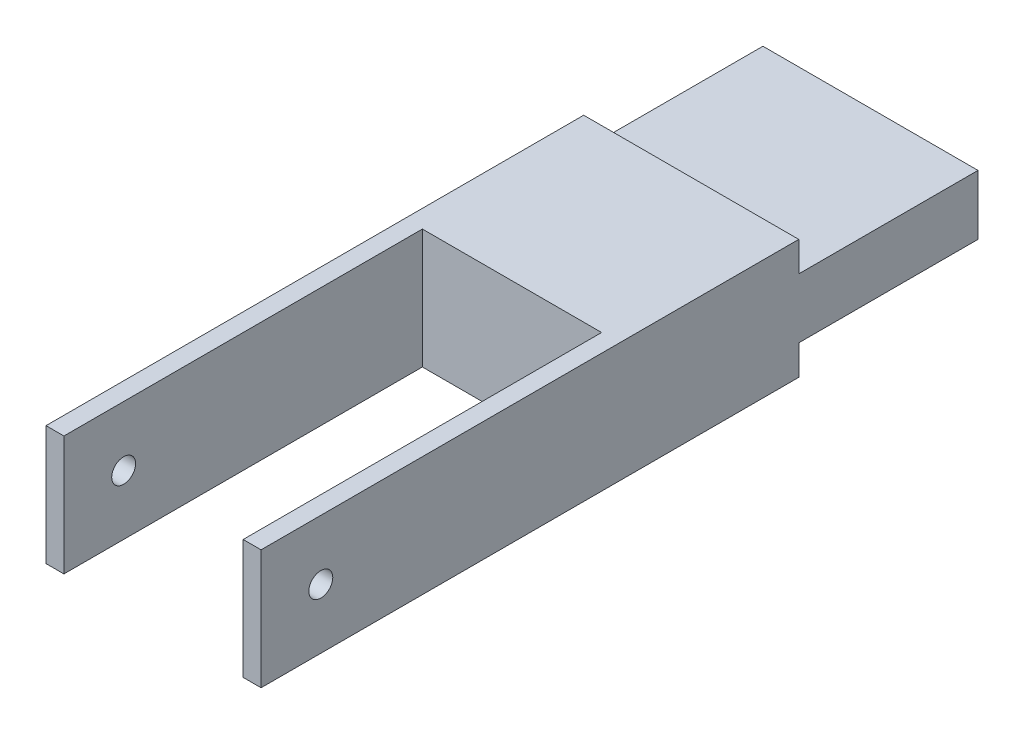
ISO-10303-21;
HEADER;
FILE_DESCRIPTION(('STEP AP214'),'2;1');
FILE_NAME('part.step','',(''),(''),'','','');
FILE_SCHEMA(('AUTOMOTIVE_DESIGN { 1 0 10303 214 1 1 1 1 }'));
ENDSEC;
DATA;
#1=APPLICATION_CONTEXT('core data for automotive mechanical design processes');
#2=APPLICATION_PROTOCOL_DEFINITION('international standard','automotive_design',2000,#1);
#3=PRODUCT_CONTEXT('',#1,'mechanical');
#4=PRODUCT('Part','Part','',(#3));
#5=PRODUCT_RELATED_PRODUCT_CATEGORY('part','',(#4));
#6=PRODUCT_DEFINITION_FORMATION('','',#4);
#7=PRODUCT_DEFINITION_CONTEXT('part definition',#1,'design');
#8=PRODUCT_DEFINITION('design','',#6,#7);
#9=PRODUCT_DEFINITION_SHAPE('','',#8);
#10=(LENGTH_UNIT() NAMED_UNIT(*) SI_UNIT(.MILLI.,.METRE.));
#11=(NAMED_UNIT(*) PLANE_ANGLE_UNIT() SI_UNIT($,.RADIAN.));
#12=(NAMED_UNIT(*) SI_UNIT($,.STERADIAN.) SOLID_ANGLE_UNIT());
#13=UNCERTAINTY_MEASURE_WITH_UNIT(LENGTH_MEASURE(1.E-05),#10,'distance_accuracy_value','');
#14=(GEOMETRIC_REPRESENTATION_CONTEXT(3) GLOBAL_UNCERTAINTY_ASSIGNED_CONTEXT((#13)) GLOBAL_UNIT_ASSIGNED_CONTEXT((#10,
#11,#12)) REPRESENTATION_CONTEXT('',''));
#15=CARTESIAN_POINT('',(0.,0.,0.));
#16=DIRECTION('',(0.,0.,1.));
#17=DIRECTION('',(1.,0.,0.));
#18=AXIS2_PLACEMENT_3D('',#15,#16,#17);
#19=CARTESIAN_POINT('',(-18.,20.,60.));
#20=DIRECTION('',(0.,0.,-1.));
#21=DIRECTION('',(-1.,0.,0.));
#22=AXIS2_PLACEMENT_3D('',#19,#20,#21);
#23=PLANE('',#22);
#24=DIRECTION('',(1.,0.,0.));
#25=VECTOR('',#24,1.);
#26=CARTESIAN_POINT('',(-18.,20.,60.));
#27=LINE('',#26,#25);
#28=CARTESIAN_POINT('',(15.,20.,60.));
#29=VERTEX_POINT('',#28);
#30=CARTESIAN_POINT('',(18.,20.,60.));
#31=VERTEX_POINT('',#30);
#32=EDGE_CURVE('E175',#29,#31,#27,.T.);
#33=ORIENTED_EDGE('',*,*,#32,.F.);
#34=DIRECTION('',(0.,-1.,0.));
#35=VECTOR('',#34,1.);
#36=CARTESIAN_POINT('',(15.,20.,60.));
#37=LINE('',#36,#35);
#38=CARTESIAN_POINT('',(15.,0.,60.));
#39=VERTEX_POINT('',#38);
#40=EDGE_CURVE('E185',#29,#39,#37,.T.);
#41=ORIENTED_EDGE('',*,*,#40,.T.);
#42=DIRECTION('',(1.,0.,0.));
#43=VECTOR('',#42,1.);
#44=CARTESIAN_POINT('',(-18.,0.,60.));
#45=LINE('',#44,#43);
#46=CARTESIAN_POINT('',(18.,0.,60.));
#47=VERTEX_POINT('',#46);
#48=EDGE_CURVE('E182',#39,#47,#45,.T.);
#49=ORIENTED_EDGE('',*,*,#48,.T.);
#50=DIRECTION('',(0.,-1.,0.));
#51=VECTOR('',#50,1.);
#52=CARTESIAN_POINT('',(18.,20.,60.));
#53=LINE('',#52,#51);
#54=EDGE_CURVE('E191',#31,#47,#53,.T.);
#55=ORIENTED_EDGE('',*,*,#54,.F.);
#56=EDGE_LOOP('',(#33,#41,#49,#55));
#57=FACE_BOUND('',#56,.T.);
#58=ADVANCED_FACE('F37',(#57),#23,.F.);
#59=CARTESIAN_POINT('',(18.,20.,-60.));
#60=DIRECTION('',(-1.,0.,0.));
#61=DIRECTION('',(0.,0.,1.));
#62=AXIS2_PLACEMENT_3D('',#59,#60,#61);
#63=PLANE('',#62);
#64=CARTESIAN_POINT('',(18.,10.,50.));
#65=DIRECTION('',(1.,0.,0.));
#66=DIRECTION('',(0.,0.,-1.));
#67=AXIS2_PLACEMENT_3D('',#64,#65,#66);
#68=CIRCLE('',#67,2.);
#69=CARTESIAN_POINT('',(18.,10.,48.));
#70=VERTEX_POINT('',#69);
#71=EDGE_CURVE('E251',#70,#70,#68,.T.);
#72=ORIENTED_EDGE('',*,*,#71,.F.);
#73=EDGE_LOOP('',(#72));
#74=FACE_BOUND('',#73,.T.);
#75=DIRECTION('',(0.,-1.,0.));
#76=VECTOR('',#75,1.);
#77=CARTESIAN_POINT('',(18.,20.,-60.));
#78=LINE('',#77,#76);
#79=CARTESIAN_POINT('',(18.,15.,-60.));
#80=VERTEX_POINT('',#79);
#81=CARTESIAN_POINT('',(18.,5.,-60.));
#82=VERTEX_POINT('',#81);
#83=EDGE_CURVE('E144',#80,#82,#78,.T.);
#84=ORIENTED_EDGE('',*,*,#83,.F.);
#85=DIRECTION('',(0.,0.,1.));
#86=VECTOR('',#85,1.);
#87=CARTESIAN_POINT('',(18.,15.,-60.));
#88=LINE('',#87,#86);
#89=CARTESIAN_POINT('',(18.,15.,-30.));
#90=VERTEX_POINT('',#89);
#91=EDGE_CURVE('E129',#80,#90,#88,.T.);
#92=ORIENTED_EDGE('',*,*,#91,.T.);
#93=DIRECTION('',(0.,1.,0.));
#94=VECTOR('',#93,1.);
#95=CARTESIAN_POINT('',(18.,20.,-30.));
#96=LINE('',#95,#94);
#97=CARTESIAN_POINT('',(18.,20.,-30.));
#98=VERTEX_POINT('',#97);
#99=EDGE_CURVE('E138',#90,#98,#96,.T.);
#100=ORIENTED_EDGE('',*,*,#99,.T.);
#101=DIRECTION('',(0.,0.,-1.));
#102=VECTOR('',#101,1.);
#103=CARTESIAN_POINT('',(18.,20.,-60.));
#104=LINE('',#103,#102);
#105=EDGE_CURVE('E170',#31,#98,#104,.T.);
#106=ORIENTED_EDGE('',*,*,#105,.F.);
#107=ORIENTED_EDGE('',*,*,#54,.T.);
#108=DIRECTION('',(0.,0.,-1.));
#109=VECTOR('',#108,1.);
#110=CARTESIAN_POINT('',(18.,0.,-60.));
#111=LINE('',#110,#109);
#112=CARTESIAN_POINT('',(18.,0.,-30.));
#113=VERTEX_POINT('',#112);
#114=EDGE_CURVE('E192',#47,#113,#111,.T.);
#115=ORIENTED_EDGE('',*,*,#114,.T.);
#116=DIRECTION('',(0.,1.,0.));
#117=VECTOR('',#116,1.);
#118=CARTESIAN_POINT('',(18.,20.,-30.));
#119=LINE('',#118,#117);
#120=CARTESIAN_POINT('',(18.,5.,-30.));
#121=VERTEX_POINT('',#120);
#122=EDGE_CURVE('E61',#113,#121,#119,.T.);
#123=ORIENTED_EDGE('',*,*,#122,.T.);
#124=DIRECTION('',(0.,0.,-1.));
#125=VECTOR('',#124,1.);
#126=CARTESIAN_POINT('',(18.,5.,-60.));
#127=LINE('',#126,#125);
#128=EDGE_CURVE('E150',#121,#82,#127,.T.);
#129=ORIENTED_EDGE('',*,*,#128,.T.);
#130=EDGE_LOOP('',(#84,#92,#100,#106,#107,#115,#123,#129));
#131=FACE_BOUND('',#130,.T.);
#132=ADVANCED_FACE('F39',(#74,#131),#63,.F.);
#133=CARTESIAN_POINT('',(-18.,20.,-60.));
#134=DIRECTION('',(0.,0.,1.));
#135=DIRECTION('',(1.,0.,0.));
#136=AXIS2_PLACEMENT_3D('',#133,#134,#135);
#137=PLANE('',#136);
#138=DIRECTION('',(0.,-1.,0.));
#139=VECTOR('',#138,1.);
#140=CARTESIAN_POINT('',(-18.,20.,-60.));
#141=LINE('',#140,#139);
#142=CARTESIAN_POINT('',(-18.,15.,-60.));
#143=VERTEX_POINT('',#142);
#144=CARTESIAN_POINT('',(-18.,5.,-60.));
#145=VERTEX_POINT('',#144);
#146=EDGE_CURVE('E146',#143,#145,#141,.T.);
#147=ORIENTED_EDGE('',*,*,#146,.F.);
#148=DIRECTION('',(-1.,0.,0.));
#149=VECTOR('',#148,1.);
#150=CARTESIAN_POINT('',(-27.2879932829561,15.,-60.));
#151=LINE('',#150,#149);
#152=EDGE_CURVE('E132',#80,#143,#151,.T.);
#153=ORIENTED_EDGE('',*,*,#152,.F.);
#154=ORIENTED_EDGE('',*,*,#83,.T.);
#155=DIRECTION('',(1.,0.,0.));
#156=VECTOR('',#155,1.);
#157=CARTESIAN_POINT('',(-26.688257166847,5.,-60.));
#158=LINE('',#157,#156);
#159=EDGE_CURVE('E137',#145,#82,#158,.T.);
#160=ORIENTED_EDGE('',*,*,#159,.F.);
#161=EDGE_LOOP('',(#147,#153,#154,#160));
#162=FACE_BOUND('',#161,.T.);
#163=ADVANCED_FACE('F142',(#162),#137,.F.);
#164=CARTESIAN_POINT('',(-18.,20.,-60.));
#165=DIRECTION('',(1.,0.,0.));
#166=DIRECTION('',(0.,0.,-1.));
#167=AXIS2_PLACEMENT_3D('',#164,#165,#166);
#168=PLANE('',#167);
#169=CARTESIAN_POINT('',(-18.,10.,50.));
#170=DIRECTION('',(1.,0.,0.));
#171=DIRECTION('',(0.,0.,-1.));
#172=AXIS2_PLACEMENT_3D('',#169,#170,#171);
#173=CIRCLE('',#172,2.);
#174=CARTESIAN_POINT('',(-18.,10.,48.));
#175=VERTEX_POINT('',#174);
#176=EDGE_CURVE('E147',#175,#175,#173,.T.);
#177=ORIENTED_EDGE('',*,*,#176,.T.);
#178=EDGE_LOOP('',(#177));
#179=FACE_BOUND('',#178,.T.);
#180=DIRECTION('',(0.,-1.,0.));
#181=VECTOR('',#180,1.);
#182=CARTESIAN_POINT('',(-18.,20.,-30.));
#183=LINE('',#182,#181);
#184=CARTESIAN_POINT('',(-18.,20.,-30.));
#185=VERTEX_POINT('',#184);
#186=CARTESIAN_POINT('',(-18.,15.,-30.));
#187=VERTEX_POINT('',#186);
#188=EDGE_CURVE('E53',#185,#187,#183,.T.);
#189=ORIENTED_EDGE('',*,*,#188,.T.);
#190=DIRECTION('',(0.,0.,-1.));
#191=VECTOR('',#190,1.);
#192=CARTESIAN_POINT('',(-18.,15.,-60.));
#193=LINE('',#192,#191);
#194=EDGE_CURVE('E11',#187,#143,#193,.T.);
#195=ORIENTED_EDGE('',*,*,#194,.T.);
#196=ORIENTED_EDGE('',*,*,#146,.T.);
#197=DIRECTION('',(0.,0.,1.));
#198=VECTOR('',#197,1.);
#199=CARTESIAN_POINT('',(-18.,5.,-60.));
#200=LINE('',#199,#198);
#201=CARTESIAN_POINT('',(-18.,5.,-30.));
#202=VERTEX_POINT('',#201);
#203=EDGE_CURVE('E161',#145,#202,#200,.T.);
#204=ORIENTED_EDGE('',*,*,#203,.T.);
#205=DIRECTION('',(0.,-1.,0.));
#206=VECTOR('',#205,1.);
#207=CARTESIAN_POINT('',(-18.,20.,-30.));
#208=LINE('',#207,#206);
#209=CARTESIAN_POINT('',(-18.,0.,-30.));
#210=VERTEX_POINT('',#209);
#211=EDGE_CURVE('E236',#202,#210,#208,.T.);
#212=ORIENTED_EDGE('',*,*,#211,.T.);
#213=DIRECTION('',(0.,0.,1.));
#214=VECTOR('',#213,1.);
#215=CARTESIAN_POINT('',(-18.,0.,-60.));
#216=LINE('',#215,#214);
#217=CARTESIAN_POINT('',(-18.,0.,60.));
#218=VERTEX_POINT('',#217);
#219=EDGE_CURVE('E195',#210,#218,#216,.T.);
#220=ORIENTED_EDGE('',*,*,#219,.T.);
#221=DIRECTION('',(0.,-1.,0.));
#222=VECTOR('',#221,1.);
#223=CARTESIAN_POINT('',(-18.,20.,60.));
#224=LINE('',#223,#222);
#225=CARTESIAN_POINT('',(-18.,20.,60.));
#226=VERTEX_POINT('',#225);
#227=EDGE_CURVE('E156',#226,#218,#224,.T.);
#228=ORIENTED_EDGE('',*,*,#227,.F.);
#229=DIRECTION('',(0.,0.,1.));
#230=VECTOR('',#229,1.);
#231=CARTESIAN_POINT('',(-18.,20.,-60.));
#232=LINE('',#231,#230);
#233=EDGE_CURVE('E177',#185,#226,#232,.T.);
#234=ORIENTED_EDGE('',*,*,#233,.F.);
#235=EDGE_LOOP('',(#189,#195,#196,#204,#212,#220,#228,#234));
#236=FACE_BOUND('',#235,.T.);
#237=ADVANCED_FACE('F267',(#179,#236),#168,.F.);
#238=CARTESIAN_POINT('',(-15.,0.,60.));
#239=VERTEX_POINT('',#238);
#240=EDGE_CURVE('E178',#218,#239,#45,.T.);
#241=ORIENTED_EDGE('',*,*,#240,.T.);
#242=DIRECTION('',(0.,1.,0.));
#243=VECTOR('',#242,1.);
#244=CARTESIAN_POINT('',(-15.,20.,60.));
#245=LINE('',#244,#243);
#246=CARTESIAN_POINT('',(-15.,20.,60.));
#247=VERTEX_POINT('',#246);
#248=EDGE_CURVE('E230',#239,#247,#245,.T.);
#249=ORIENTED_EDGE('',*,*,#248,.T.);
#250=EDGE_CURVE('E188',#226,#247,#27,.T.);
#251=ORIENTED_EDGE('',*,*,#250,.F.);
#252=ORIENTED_EDGE('',*,*,#227,.T.);
#253=EDGE_LOOP('',(#241,#249,#251,#252));
#254=FACE_BOUND('',#253,.T.);
#255=ADVANCED_FACE('F202',(#254),#23,.F.);
#256=CARTESIAN_POINT('',(0.,20.,0.));
#257=DIRECTION('',(0.,1.,0.));
#258=DIRECTION('',(0.,0.,1.));
#259=AXIS2_PLACEMENT_3D('',#256,#257,#258);
#260=PLANE('',#259);
#261=DIRECTION('',(1.,0.,0.));
#262=VECTOR('',#261,1.);
#263=CARTESIAN_POINT('',(0.,20.,-30.));
#264=LINE('',#263,#262);
#265=EDGE_CURVE('E46',#185,#98,#264,.T.);
#266=ORIENTED_EDGE('',*,*,#265,.F.);
#267=ORIENTED_EDGE('',*,*,#233,.T.);
#268=ORIENTED_EDGE('',*,*,#250,.T.);
#269=DIRECTION('',(0.,0.,1.));
#270=VECTOR('',#269,1.);
#271=CARTESIAN_POINT('',(-15.,20.,76.6422912499171));
#272=LINE('',#271,#270);
#273=CARTESIAN_POINT('',(-15.,20.,0.));
#274=VERTEX_POINT('',#273);
#275=EDGE_CURVE('E220',#274,#247,#272,.T.);
#276=ORIENTED_EDGE('',*,*,#275,.F.);
#277=DIRECTION('',(-1.,0.,0.));
#278=VECTOR('',#277,1.);
#279=CARTESIAN_POINT('',(15.,20.,0.));
#280=LINE('',#279,#278);
#281=CARTESIAN_POINT('',(15.,20.,0.));
#282=VERTEX_POINT('',#281);
#283=EDGE_CURVE('E226',#282,#274,#280,.T.);
#284=ORIENTED_EDGE('',*,*,#283,.F.);
#285=DIRECTION('',(0.,0.,-1.));
#286=VECTOR('',#285,1.);
#287=CARTESIAN_POINT('',(15.,20.,76.6422912499171));
#288=LINE('',#287,#286);
#289=EDGE_CURVE('E224',#29,#282,#288,.T.);
#290=ORIENTED_EDGE('',*,*,#289,.F.);
#291=ORIENTED_EDGE('',*,*,#32,.T.);
#292=ORIENTED_EDGE('',*,*,#105,.T.);
#293=EDGE_LOOP('',(#266,#267,#268,#276,#284,#290,#291,#292));
#294=FACE_BOUND('',#293,.T.);
#295=ADVANCED_FACE('F172',(#294),#260,.T.);
#296=CARTESIAN_POINT('',(0.,0.,0.));
#297=DIRECTION('',(0.,1.,0.));
#298=DIRECTION('',(0.,0.,1.));
#299=AXIS2_PLACEMENT_3D('',#296,#297,#298);
#300=PLANE('',#299);
#301=ORIENTED_EDGE('',*,*,#219,.F.);
#302=DIRECTION('',(1.,0.,0.));
#303=VECTOR('',#302,1.);
#304=CARTESIAN_POINT('',(0.,0.,-30.));
#305=LINE('',#304,#303);
#306=EDGE_CURVE('E154',#210,#113,#305,.T.);
#307=ORIENTED_EDGE('',*,*,#306,.T.);
#308=ORIENTED_EDGE('',*,*,#114,.F.);
#309=ORIENTED_EDGE('',*,*,#48,.F.);
#310=DIRECTION('',(0.,0.,-1.));
#311=VECTOR('',#310,1.);
#312=CARTESIAN_POINT('',(15.,0.,0.));
#313=LINE('',#312,#311);
#314=CARTESIAN_POINT('',(15.,0.,0.));
#315=VERTEX_POINT('',#314);
#316=EDGE_CURVE('E151',#39,#315,#313,.T.);
#317=ORIENTED_EDGE('',*,*,#316,.T.);
#318=DIRECTION('',(-1.,0.,0.));
#319=VECTOR('',#318,1.);
#320=CARTESIAN_POINT('',(15.,0.,0.));
#321=LINE('',#320,#319);
#322=CARTESIAN_POINT('',(-15.,0.,0.));
#323=VERTEX_POINT('',#322);
#324=EDGE_CURVE('E212',#315,#323,#321,.T.);
#325=ORIENTED_EDGE('',*,*,#324,.T.);
#326=DIRECTION('',(0.,0.,1.));
#327=VECTOR('',#326,1.);
#328=CARTESIAN_POINT('',(-15.,0.,76.6422912499171));
#329=LINE('',#328,#327);
#330=EDGE_CURVE('E210',#323,#239,#329,.T.);
#331=ORIENTED_EDGE('',*,*,#330,.T.);
#332=ORIENTED_EDGE('',*,*,#240,.F.);
#333=EDGE_LOOP('',(#301,#307,#308,#309,#317,#325,#331,#332));
#334=FACE_BOUND('',#333,.T.);
#335=ADVANCED_FACE('F208',(#334),#300,.F.);
#336=CARTESIAN_POINT('',(15.,0.,76.6422912499171));
#337=DIRECTION('',(1.,0.,0.));
#338=DIRECTION('',(0.,0.,-1.));
#339=AXIS2_PLACEMENT_3D('',#336,#337,#338);
#340=PLANE('',#339);
#341=CARTESIAN_POINT('',(15.,10.,50.));
#342=DIRECTION('',(1.,0.,0.));
#343=DIRECTION('',(0.,0.,-1.));
#344=AXIS2_PLACEMENT_3D('',#341,#342,#343);
#345=CIRCLE('',#344,2.);
#346=CARTESIAN_POINT('',(15.,10.,48.));
#347=VERTEX_POINT('',#346);
#348=EDGE_CURVE('E248',#347,#347,#345,.T.);
#349=ORIENTED_EDGE('',*,*,#348,.T.);
#350=EDGE_LOOP('',(#349));
#351=FACE_BOUND('',#350,.T.);
#352=ORIENTED_EDGE('',*,*,#289,.T.);
#353=DIRECTION('',(0.,1.,0.));
#354=VECTOR('',#353,1.);
#355=CARTESIAN_POINT('',(15.,0.,0.));
#356=LINE('',#355,#354);
#357=EDGE_CURVE('E215',#315,#282,#356,.T.);
#358=ORIENTED_EDGE('',*,*,#357,.F.);
#359=ORIENTED_EDGE('',*,*,#316,.F.);
#360=ORIENTED_EDGE('',*,*,#40,.F.);
#361=EDGE_LOOP('',(#352,#358,#359,#360));
#362=FACE_BOUND('',#361,.T.);
#363=ADVANCED_FACE('F274',(#351,#362),#340,.F.);
#364=CARTESIAN_POINT('',(-15.,0.,76.6422912499171));
#365=DIRECTION('',(-1.,0.,0.));
#366=DIRECTION('',(0.,0.,1.));
#367=AXIS2_PLACEMENT_3D('',#364,#365,#366);
#368=PLANE('',#367);
#369=CARTESIAN_POINT('',(-15.,10.,50.));
#370=DIRECTION('',(-1.,0.,0.));
#371=DIRECTION('',(0.,0.,1.));
#372=AXIS2_PLACEMENT_3D('',#369,#370,#371);
#373=CIRCLE('',#372,2.);
#374=CARTESIAN_POINT('',(-15.,10.,52.));
#375=VERTEX_POINT('',#374);
#376=EDGE_CURVE('E41',#375,#375,#373,.T.);
#377=ORIENTED_EDGE('',*,*,#376,.T.);
#378=EDGE_LOOP('',(#377));
#379=FACE_BOUND('',#378,.T.);
#380=ORIENTED_EDGE('',*,*,#330,.F.);
#381=DIRECTION('',(0.,1.,0.));
#382=VECTOR('',#381,1.);
#383=CARTESIAN_POINT('',(-15.,0.,0.));
#384=LINE('',#383,#382);
#385=EDGE_CURVE('E218',#323,#274,#384,.T.);
#386=ORIENTED_EDGE('',*,*,#385,.T.);
#387=ORIENTED_EDGE('',*,*,#275,.T.);
#388=ORIENTED_EDGE('',*,*,#248,.F.);
#389=EDGE_LOOP('',(#380,#386,#387,#388));
#390=FACE_BOUND('',#389,.T.);
#391=ADVANCED_FACE('F258',(#379,#390),#368,.F.);
#392=CARTESIAN_POINT('',(15.,0.,0.));
#393=DIRECTION('',(0.,0.,-1.));
#394=DIRECTION('',(-1.,0.,0.));
#395=AXIS2_PLACEMENT_3D('',#392,#393,#394);
#396=PLANE('',#395);
#397=ORIENTED_EDGE('',*,*,#283,.T.);
#398=ORIENTED_EDGE('',*,*,#385,.F.);
#399=ORIENTED_EDGE('',*,*,#324,.F.);
#400=ORIENTED_EDGE('',*,*,#357,.T.);
#401=EDGE_LOOP('',(#397,#398,#399,#400));
#402=FACE_BOUND('',#401,.T.);
#403=ADVANCED_FACE('F273',(#402),#396,.F.);
#404=CARTESIAN_POINT('',(-26.688257166847,5.,-30.));
#405=DIRECTION('',(0.,1.,0.));
#406=DIRECTION('',(0.,0.,1.));
#407=AXIS2_PLACEMENT_3D('',#404,#405,#406);
#408=PLANE('',#407);
#409=DIRECTION('',(1.,0.,0.));
#410=VECTOR('',#409,1.);
#411=CARTESIAN_POINT('',(-26.688257166847,5.,-30.));
#412=LINE('',#411,#410);
#413=EDGE_CURVE('E239',#202,#121,#412,.T.);
#414=ORIENTED_EDGE('',*,*,#413,.F.);
#415=ORIENTED_EDGE('',*,*,#203,.F.);
#416=ORIENTED_EDGE('',*,*,#159,.T.);
#417=ORIENTED_EDGE('',*,*,#128,.F.);
#418=EDGE_LOOP('',(#414,#415,#416,#417));
#419=FACE_BOUND('',#418,.T.);
#420=ADVANCED_FACE('F309',(#419),#408,.F.);
#421=CARTESIAN_POINT('',(0.,0.,-30.));
#422=DIRECTION('',(0.,0.,1.));
#423=DIRECTION('',(1.,0.,0.));
#424=AXIS2_PLACEMENT_3D('',#421,#422,#423);
#425=PLANE('',#424);
#426=ORIENTED_EDGE('',*,*,#306,.F.);
#427=ORIENTED_EDGE('',*,*,#211,.F.);
#428=ORIENTED_EDGE('',*,*,#413,.T.);
#429=ORIENTED_EDGE('',*,*,#122,.F.);
#430=EDGE_LOOP('',(#426,#427,#428,#429));
#431=FACE_BOUND('',#430,.T.);
#432=ADVANCED_FACE('F314',(#431),#425,.F.);
#433=CARTESIAN_POINT('',(-27.2879932829561,15.,-30.));
#434=DIRECTION('',(0.,-1.,0.));
#435=DIRECTION('',(0.,0.,-1.));
#436=AXIS2_PLACEMENT_3D('',#433,#434,#435);
#437=PLANE('',#436);
#438=ORIENTED_EDGE('',*,*,#152,.T.);
#439=ORIENTED_EDGE('',*,*,#194,.F.);
#440=DIRECTION('',(-1.,0.,0.));
#441=VECTOR('',#440,1.);
#442=CARTESIAN_POINT('',(-27.2879932829561,15.,-30.));
#443=LINE('',#442,#441);
#444=EDGE_CURVE('E133',#90,#187,#443,.T.);
#445=ORIENTED_EDGE('',*,*,#444,.F.);
#446=ORIENTED_EDGE('',*,*,#91,.F.);
#447=EDGE_LOOP('',(#438,#439,#445,#446));
#448=FACE_BOUND('',#447,.T.);
#449=ADVANCED_FACE('F131',(#448),#437,.F.);
#450=CARTESIAN_POINT('',(0.,0.,-30.));
#451=DIRECTION('',(0.,0.,1.));
#452=DIRECTION('',(1.,0.,0.));
#453=AXIS2_PLACEMENT_3D('',#450,#451,#452);
#454=PLANE('',#453);
#455=ORIENTED_EDGE('',*,*,#444,.T.);
#456=ORIENTED_EDGE('',*,*,#188,.F.);
#457=ORIENTED_EDGE('',*,*,#265,.T.);
#458=ORIENTED_EDGE('',*,*,#99,.F.);
#459=EDGE_LOOP('',(#455,#456,#457,#458));
#460=FACE_BOUND('',#459,.T.);
#461=ADVANCED_FACE('F164',(#460),#454,.F.);
#462=CARTESIAN_POINT('',(-52.,10.,50.));
#463=DIRECTION('',(1.,0.,0.));
#464=DIRECTION('',(0.,0.,-1.));
#465=AXIS2_PLACEMENT_3D('',#462,#463,#464);
#466=CYLINDRICAL_SURFACE('',#465,2.);
#467=ORIENTED_EDGE('',*,*,#376,.F.);
#468=EDGE_LOOP('',(#467));
#469=FACE_BOUND('',#468,.T.);
#470=ORIENTED_EDGE('',*,*,#176,.F.);
#471=EDGE_LOOP('',(#470));
#472=FACE_BOUND('',#471,.T.);
#473=ADVANCED_FACE('F260',(#469,#472),#466,.F.);
#474=ORIENTED_EDGE('',*,*,#71,.T.);
#475=EDGE_LOOP('',(#474));
#476=FACE_BOUND('',#475,.T.);
#477=ORIENTED_EDGE('',*,*,#348,.F.);
#478=EDGE_LOOP('',(#477));
#479=FACE_BOUND('',#478,.T.);
#480=ADVANCED_FACE('F263',(#476,#479),#466,.F.);
#481=CLOSED_SHELL('',(#58,#132,#163,#237,#255,#295,#335,#363,#391,#403,#420,#432,#449,#461,#473,#480));
#482=MANIFOLD_SOLID_BREP('B2',#481);
#483=ADVANCED_BREP_SHAPE_REPRESENTATION('',(#18,#482),#14);
#484=SHAPE_DEFINITION_REPRESENTATION(#9,#483);
ENDSEC;
END-ISO-10303-21;
